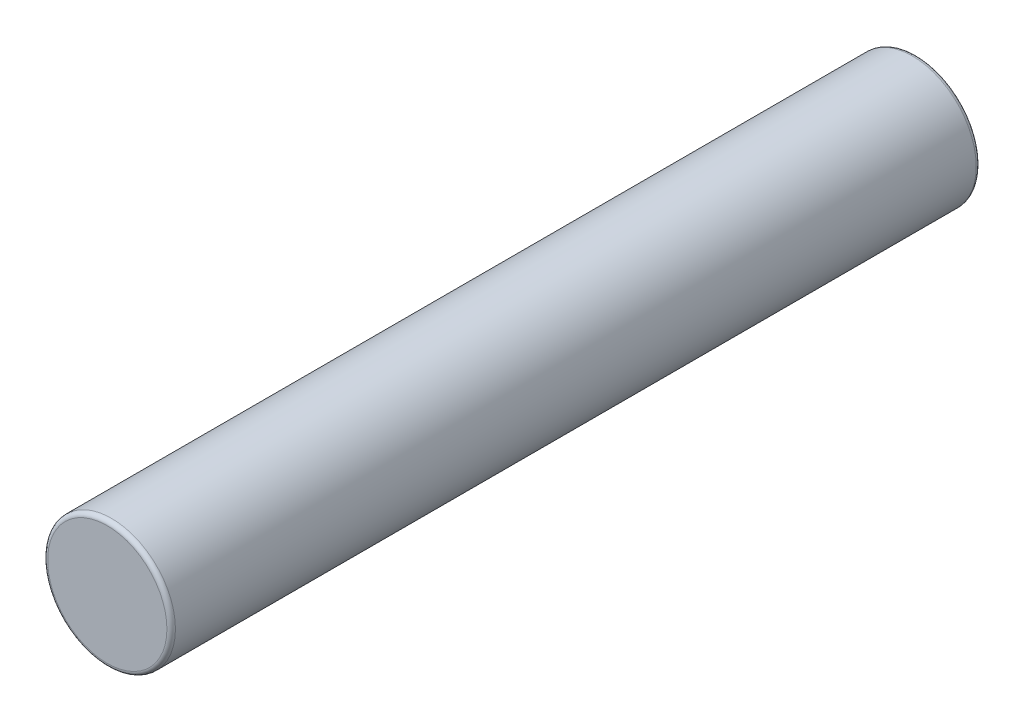
ISO-10303-21;
HEADER;
FILE_DESCRIPTION(('STEP AP214'),'2;1');
FILE_NAME('part.step','',(''),(''),'','','');
FILE_SCHEMA(('AUTOMOTIVE_DESIGN { 1 0 10303 214 1 1 1 1 }'));
ENDSEC;
DATA;
#1=APPLICATION_CONTEXT('core data for automotive mechanical design processes');
#2=APPLICATION_PROTOCOL_DEFINITION('international standard','automotive_design',2000,#1);
#3=PRODUCT_CONTEXT('',#1,'mechanical');
#4=PRODUCT('Part','Part','',(#3));
#5=PRODUCT_RELATED_PRODUCT_CATEGORY('part','',(#4));
#6=PRODUCT_DEFINITION_FORMATION('','',#4);
#7=PRODUCT_DEFINITION_CONTEXT('part definition',#1,'design');
#8=PRODUCT_DEFINITION('design','',#6,#7);
#9=PRODUCT_DEFINITION_SHAPE('','',#8);
#10=(LENGTH_UNIT() NAMED_UNIT(*) SI_UNIT(.MILLI.,.METRE.));
#11=(NAMED_UNIT(*) PLANE_ANGLE_UNIT() SI_UNIT($,.RADIAN.));
#12=(NAMED_UNIT(*) SI_UNIT($,.STERADIAN.) SOLID_ANGLE_UNIT());
#13=UNCERTAINTY_MEASURE_WITH_UNIT(LENGTH_MEASURE(1.E-05),#10,'distance_accuracy_value','');
#14=(GEOMETRIC_REPRESENTATION_CONTEXT(3) GLOBAL_UNCERTAINTY_ASSIGNED_CONTEXT((#13)) GLOBAL_UNIT_ASSIGNED_CONTEXT((#10,
#11,#12)) REPRESENTATION_CONTEXT('',''));
#15=CARTESIAN_POINT('',(0.,0.,0.));
#16=DIRECTION('',(0.,0.,1.));
#17=DIRECTION('',(1.,0.,0.));
#18=AXIS2_PLACEMENT_3D('',#15,#16,#17);
#19=CARTESIAN_POINT('',(0.,0.,-4.75));
#20=DIRECTION('',(0.,0.,1.));
#21=DIRECTION('',(1.,0.,0.));
#22=AXIS2_PLACEMENT_3D('',#19,#20,#21);
#23=CYLINDRICAL_SURFACE('',#22,0.75);
#24=CARTESIAN_POINT('',(0.,0.,-4.7));
#25=DIRECTION('',(0.,0.,1.));
#26=DIRECTION('',(1.,0.,0.));
#27=AXIS2_PLACEMENT_3D('',#24,#25,#26);
#28=CIRCLE('',#27,0.75);
#29=CARTESIAN_POINT('',(0.75,0.,-4.7));
#30=VERTEX_POINT('',#29);
#31=EDGE_CURVE('E44',#30,#30,#28,.T.);
#32=ORIENTED_EDGE('',*,*,#31,.T.);
#33=EDGE_LOOP('',(#32));
#34=FACE_BOUND('',#33,.T.);
#35=CARTESIAN_POINT('',(0.,0.,4.7));
#36=DIRECTION('',(0.,0.,1.));
#37=DIRECTION('',(1.,0.,0.));
#38=AXIS2_PLACEMENT_3D('',#35,#36,#37);
#39=CIRCLE('',#38,0.75);
#40=CARTESIAN_POINT('',(0.75,0.,4.7));
#41=VERTEX_POINT('',#40);
#42=EDGE_CURVE('E48',#41,#41,#39,.F.);
#43=ORIENTED_EDGE('',*,*,#42,.T.);
#44=EDGE_LOOP('',(#43));
#45=FACE_BOUND('',#44,.T.);
#46=ADVANCED_FACE('F33',(#34,#45),#23,.T.);
#47=CARTESIAN_POINT('',(0.,0.,-4.75));
#48=DIRECTION('',(0.,0.,1.));
#49=DIRECTION('',(1.,0.,0.));
#50=AXIS2_PLACEMENT_3D('',#47,#48,#49);
#51=PLANE('',#50);
#52=CARTESIAN_POINT('',(0.,0.,-4.75));
#53=DIRECTION('',(0.,0.,1.));
#54=DIRECTION('',(1.,0.,0.));
#55=AXIS2_PLACEMENT_3D('',#52,#53,#54);
#56=CIRCLE('',#55,0.7);
#57=CARTESIAN_POINT('',(0.7,0.,-4.75));
#58=VERTEX_POINT('',#57);
#59=EDGE_CURVE('E40',#58,#58,#56,.F.);
#60=ORIENTED_EDGE('',*,*,#59,.T.);
#61=EDGE_LOOP('',(#60));
#62=FACE_BOUND('',#61,.T.);
#63=ADVANCED_FACE('F64',(#62),#51,.F.);
#64=CARTESIAN_POINT('',(0.,0.,4.75));
#65=DIRECTION('',(0.,0.,1.));
#66=DIRECTION('',(1.,0.,0.));
#67=AXIS2_PLACEMENT_3D('',#64,#65,#66);
#68=PLANE('',#67);
#69=CARTESIAN_POINT('',(0.,0.,4.75));
#70=DIRECTION('',(0.,0.,1.));
#71=DIRECTION('',(1.,0.,0.));
#72=AXIS2_PLACEMENT_3D('',#69,#70,#71);
#73=CIRCLE('',#72,0.7);
#74=CARTESIAN_POINT('',(0.7,0.,4.75));
#75=VERTEX_POINT('',#74);
#76=EDGE_CURVE('E10',#75,#75,#73,.T.);
#77=ORIENTED_EDGE('',*,*,#76,.T.);
#78=EDGE_LOOP('',(#77));
#79=FACE_BOUND('',#78,.T.);
#80=ADVANCED_FACE('F61',(#79),#68,.T.);
#81=CARTESIAN_POINT('',(0.,0.,-4.7));
#82=DIRECTION('',(0.,0.,1.));
#83=DIRECTION('',(1.,0.,0.));
#84=AXIS2_PLACEMENT_3D('',#81,#82,#83);
#85=TOROIDAL_SURFACE('',#84,0.7,0.05);
#86=ORIENTED_EDGE('',*,*,#59,.F.);
#87=EDGE_LOOP('',(#86));
#88=FACE_BOUND('',#87,.T.);
#89=ORIENTED_EDGE('',*,*,#31,.F.);
#90=EDGE_LOOP('',(#89));
#91=FACE_BOUND('',#90,.T.);
#92=ADVANCED_FACE('F57',(#88,#91),#85,.T.);
#93=CARTESIAN_POINT('',(0.,0.,4.7));
#94=DIRECTION('',(0.,0.,1.));
#95=DIRECTION('',(1.,0.,0.));
#96=AXIS2_PLACEMENT_3D('',#93,#94,#95);
#97=TOROIDAL_SURFACE('',#96,0.7,0.05);
#98=ORIENTED_EDGE('',*,*,#42,.F.);
#99=EDGE_LOOP('',(#98));
#100=FACE_BOUND('',#99,.T.);
#101=ORIENTED_EDGE('',*,*,#76,.F.);
#102=EDGE_LOOP('',(#101));
#103=FACE_BOUND('',#102,.T.);
#104=ADVANCED_FACE('F35',(#100,#103),#97,.T.);
#105=CLOSED_SHELL('',(#46,#63,#80,#92,#104));
#106=MANIFOLD_SOLID_BREP('B2',#105);
#107=ADVANCED_BREP_SHAPE_REPRESENTATION('',(#18,#106),#14);
#108=SHAPE_DEFINITION_REPRESENTATION(#9,#107);
ENDSEC;
END-ISO-10303-21;
